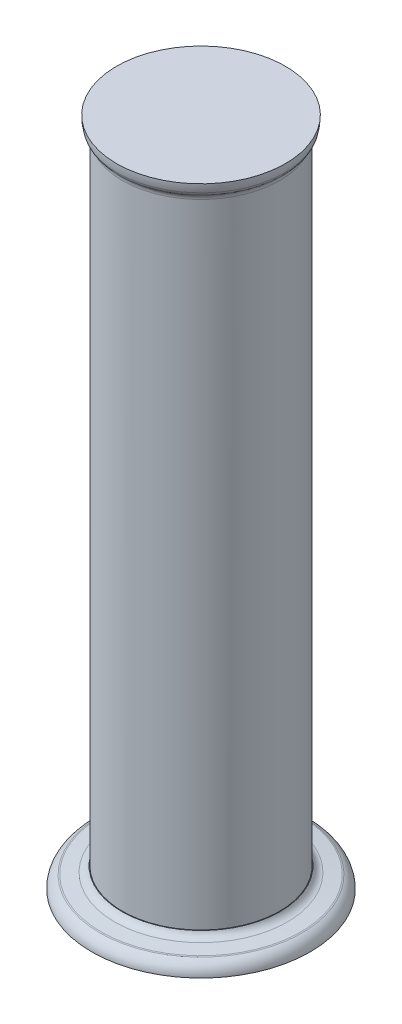
ISO-10303-21;
HEADER;
FILE_DESCRIPTION(('STEP AP214'),'2;1');
FILE_NAME('part.step','',(''),(''),'','','');
FILE_SCHEMA(('AUTOMOTIVE_DESIGN { 1 0 10303 214 1 1 1 1 }'));
ENDSEC;
DATA;
#1=APPLICATION_CONTEXT('core data for automotive mechanical design processes');
#2=APPLICATION_PROTOCOL_DEFINITION('international standard','automotive_design',2000,#1);
#3=PRODUCT_CONTEXT('',#1,'mechanical');
#4=PRODUCT('Part','Part','',(#3));
#5=PRODUCT_RELATED_PRODUCT_CATEGORY('part','',(#4));
#6=PRODUCT_DEFINITION_FORMATION('','',#4);
#7=PRODUCT_DEFINITION_CONTEXT('part definition',#1,'design');
#8=PRODUCT_DEFINITION('design','',#6,#7);
#9=PRODUCT_DEFINITION_SHAPE('','',#8);
#10=(LENGTH_UNIT() NAMED_UNIT(*) SI_UNIT(.MILLI.,.METRE.));
#11=(NAMED_UNIT(*) PLANE_ANGLE_UNIT() SI_UNIT($,.RADIAN.));
#12=(NAMED_UNIT(*) SI_UNIT($,.STERADIAN.) SOLID_ANGLE_UNIT());
#13=UNCERTAINTY_MEASURE_WITH_UNIT(LENGTH_MEASURE(1.E-05),#10,'distance_accuracy_value','');
#14=(GEOMETRIC_REPRESENTATION_CONTEXT(3) GLOBAL_UNCERTAINTY_ASSIGNED_CONTEXT((#13)) GLOBAL_UNIT_ASSIGNED_CONTEXT((#10,
#11,#12)) REPRESENTATION_CONTEXT('',''));
#15=CARTESIAN_POINT('',(0.,0.,0.));
#16=DIRECTION('',(0.,0.,1.));
#17=DIRECTION('',(1.,0.,0.));
#18=AXIS2_PLACEMENT_3D('',#15,#16,#17);
#19=CARTESIAN_POINT('',(-3.29577813896613E-12,213.800000000003,-251.000000000001));
#20=DIRECTION('',(0.,-1.,0.));
#21=DIRECTION('',(0.,0.,-1.));
#22=AXIS2_PLACEMENT_3D('',#19,#20,#21);
#23=PLANE('',#22);
#24=CARTESIAN_POINT('',(-3.29766225910432E-12,213.800000000003,-176.000000000001));
#25=DIRECTION('',(0.,1.,0.));
#26=DIRECTION('',(0.,0.,1.));
#27=AXIS2_PLACEMENT_3D('',#24,#25,#26);
#28=CIRCLE('',#27,75.);
#29=CARTESIAN_POINT('',(-3.29766225910432E-12,213.800000000003,-101.000000000001));
#30=VERTEX_POINT('',#29);
#31=EDGE_CURVE('E33',#30,#30,#28,.T.);
#32=ORIENTED_EDGE('',*,*,#31,.F.);
#33=EDGE_LOOP('',(#32));
#34=FACE_BOUND('',#33,.T.);
#35=ADVANCED_FACE('F30',(#34),#23,.T.);
#36=CARTESIAN_POINT('',(-3.29766225910432E-12,213.800000000003,-176.000000000001));
#37=DIRECTION('',(0.,1.,0.));
#38=DIRECTION('',(0.,0.,1.));
#39=AXIS2_PLACEMENT_3D('',#36,#37,#38);
#40=TOROIDAL_SURFACE('',#39,65.5989529684485,9.40104703155155);
#41=CARTESIAN_POINT('',(-3.29781962002054E-12,222.366147078511,-176.000000000001));
#42=DIRECTION('',(0.,1.,0.));
#43=DIRECTION('',(0.,0.,1.));
#44=AXIS2_PLACEMENT_3D('',#41,#42,#43);
#45=CIRCLE('',#44,69.4720408216769);
#46=CARTESIAN_POINT('',(-3.29781962002054E-12,222.366147078511,-106.527959178324));
#47=VERTEX_POINT('',#46);
#48=EDGE_CURVE('E79',#47,#47,#45,.T.);
#49=ORIENTED_EDGE('',*,*,#48,.F.);
#50=EDGE_LOOP('',(#49));
#51=FACE_BOUND('',#50,.T.);
#52=ORIENTED_EDGE('',*,*,#31,.T.);
#53=EDGE_LOOP('',(#52));
#54=FACE_BOUND('',#53,.T.);
#55=ADVANCED_FACE('F88',(#51,#54),#40,.T.);
#56=CARTESIAN_POINT('',(-3.29781962002054E-12,219.780358568721,-176.000000000001));
#57=DIRECTION('',(0.,1.,0.));
#58=DIRECTION('',(0.,0.,1.));
#59=AXIS2_PLACEMENT_3D('',#56,#57,#58);
#60=TOROIDAL_SURFACE('',#59,68.3029053893175,2.83781251610467);
#61=CARTESIAN_POINT('',(-3.30202314347965E-12,222.59701846066,-176.000000000001));
#62=DIRECTION('',(0.,-1.,0.));
#63=DIRECTION('',(0.,0.,1.));
#64=AXIS2_PLACEMENT_3D('',#61,#62,#63);
#65=CIRCLE('',#64,68.6487477373621);
#66=CARTESIAN_POINT('',(-3.30773930000587E-12,222.59701846066,-107.351252262639));
#67=VERTEX_POINT('',#66);
#68=EDGE_CURVE('E76',#67,#67,#65,.F.);
#69=ORIENTED_EDGE('',*,*,#68,.F.);
#70=EDGE_LOOP('',(#69));
#71=FACE_BOUND('',#70,.T.);
#72=ORIENTED_EDGE('',*,*,#48,.T.);
#73=EDGE_LOOP('',(#72));
#74=FACE_BOUND('',#73,.T.);
#75=ADVANCED_FACE('F84',(#71,#74),#60,.T.);
#76=CARTESIAN_POINT('',(-3.29719371126791E-12,674.400000000003,-233.999544291101));
#77=DIRECTION('',(0.,1.,0.));
#78=DIRECTION('',(0.,0.,1.));
#79=AXIS2_PLACEMENT_3D('',#76,#77,#78);
#80=PLANE('',#79);
#81=CARTESIAN_POINT('',(-3.29847169566624E-12,674.400000000003,-176.000000000001));
#82=DIRECTION('',(0.,1.,0.));
#83=DIRECTION('',(0.,0.,1.));
#84=AXIS2_PLACEMENT_3D('',#81,#82,#83);
#85=CIRCLE('',#84,57.9995442910995);
#86=CARTESIAN_POINT('',(-3.29847169566624E-12,674.400000000003,-118.000455708902));
#87=VERTEX_POINT('',#86);
#88=EDGE_CURVE('E73',#87,#87,#85,.F.);
#89=ORIENTED_EDGE('',*,*,#88,.F.);
#90=EDGE_LOOP('',(#89));
#91=FACE_BOUND('',#90,.T.);
#92=ADVANCED_FACE('F87',(#91),#80,.T.);
#93=CARTESIAN_POINT('',(-3.30202314347965E-12,222.59701846066,-176.000000000001));
#94=DIRECTION('',(0.,-1.,0.));
#95=DIRECTION('',(0.,0.,-1.));
#96=AXIS2_PLACEMENT_3D('',#93,#94,#95);
#97=CONICAL_SURFACE('',#96,68.6487477373623,1.4486232791553);
#98=ORIENTED_EDGE('',*,*,#68,.T.);
#99=EDGE_LOOP('',(#98));
#100=FACE_BOUND('',#99,.T.);
#101=CARTESIAN_POINT('',(-3.30565230980669E-12,223.748733196857,-176.000000000001));
#102=DIRECTION('',(0.,1.,0.));
#103=DIRECTION('',(0.,0.,1.));
#104=AXIS2_PLACEMENT_3D('',#101,#102,#103);
#105=CIRCLE('',#104,59.2687839395692);
#106=CARTESIAN_POINT('',(-3.30565230980669E-12,223.748733196857,-116.731216060432));
#107=VERTEX_POINT('',#106);
#108=EDGE_CURVE('E71',#107,#107,#105,.F.);
#109=ORIENTED_EDGE('',*,*,#108,.T.);
#110=EDGE_LOOP('',(#109));
#111=FACE_BOUND('',#110,.T.);
#112=ADVANCED_FACE('F104',(#100,#111),#97,.T.);
#113=CARTESIAN_POINT('',(-3.29847169566624E-12,674.548999036331,-176.000000000001));
#114=DIRECTION('',(0.,1.,0.));
#115=DIRECTION('',(0.,0.,1.));
#116=AXIS2_PLACEMENT_3D('',#113,#114,#115);
#117=TOROIDAL_SURFACE('',#116,33.642434735737,24.3575652848301);
#118=ORIENTED_EDGE('',*,*,#88,.T.);
#119=EDGE_LOOP('',(#118));
#120=FACE_BOUND('',#119,.T.);
#121=CARTESIAN_POINT('',(-3.29851886267183E-12,668.470084925447,-176.000000000001));
#122=DIRECTION('',(0.,1.,0.));
#123=DIRECTION('',(0.,0.,1.));
#124=AXIS2_PLACEMENT_3D('',#121,#122,#123);
#125=CIRCLE('',#124,57.2292486332781);
#126=CARTESIAN_POINT('',(-3.29851886267183E-12,668.470084925447,-118.770751366723));
#127=VERTEX_POINT('',#126);
#128=EDGE_CURVE('E50',#127,#127,#125,.F.);
#129=ORIENTED_EDGE('',*,*,#128,.F.);
#130=EDGE_LOOP('',(#129));
#131=FACE_BOUND('',#130,.T.);
#132=ADVANCED_FACE('F64',(#120,#131),#117,.T.);
#133=CARTESIAN_POINT('',(-3.30547800626991E-12,229.704010106705,-176.000000000001));
#134=DIRECTION('',(0.,1.,0.));
#135=DIRECTION('',(0.,0.,1.));
#136=AXIS2_PLACEMENT_3D('',#133,#134,#135);
#137=TOROIDAL_SURFACE('',#136,60.,6.00000000000001);
#138=ORIENTED_EDGE('',*,*,#108,.F.);
#139=EDGE_LOOP('',(#138));
#140=FACE_BOUND('',#139,.T.);
#141=CARTESIAN_POINT('',(-3.3055410530962E-12,227.549944183851,-176.000000000001));
#142=DIRECTION('',(0.,1.,0.));
#143=DIRECTION('',(0.,0.,1.));
#144=AXIS2_PLACEMENT_3D('',#141,#142,#143);
#145=CIRCLE('',#144,54.4);
#146=CARTESIAN_POINT('',(-3.3055410530962E-12,227.549944183851,-121.600000000001));
#147=VERTEX_POINT('',#146);
#148=EDGE_CURVE('E96',#147,#147,#145,.T.);
#149=ORIENTED_EDGE('',*,*,#148,.F.);
#150=EDGE_LOOP('',(#149));
#151=FACE_BOUND('',#150,.T.);
#152=ADVANCED_FACE('F58',(#140,#151),#137,.F.);
#153=CARTESIAN_POINT('',(-3.29851886267183E-12,669.71793421576,-176.000000000001));
#154=DIRECTION('',(0.,1.,0.));
#155=DIRECTION('',(0.,0.,1.));
#156=AXIS2_PLACEMENT_3D('',#153,#154,#155);
#157=TOROIDAL_SURFACE('',#156,52.3874646491793,5.00000000000109);
#158=ORIENTED_EDGE('',*,*,#128,.T.);
#159=EDGE_LOOP('',(#158));
#160=FACE_BOUND('',#159,.T.);
#161=CARTESIAN_POINT('',(-3.30328899422403E-12,666.220594287331,-176.000000000001));
#162=DIRECTION('',(0.,1.,0.));
#163=DIRECTION('',(-1.,0.,0.));
#164=AXIS2_PLACEMENT_3D('',#161,#162,#163);
#165=CIRCLE('',#164,55.9607843137254);
#166=CARTESIAN_POINT('',(-55.9607843137287,666.220594287331,-176.000000000001));
#167=VERTEX_POINT('',#166);
#168=EDGE_CURVE('E42',#167,#167,#165,.T.);
#169=ORIENTED_EDGE('',*,*,#168,.T.);
#170=EDGE_LOOP('',(#169));
#171=FACE_BOUND('',#170,.T.);
#172=ADVANCED_FACE('F53',(#160,#171),#157,.T.);
#173=CARTESIAN_POINT('',(-3.29749343353917E-12,227.549944183851,-230.400000000001));
#174=DIRECTION('',(0.,1.,0.));
#175=DIRECTION('',(0.,0.,1.));
#176=AXIS2_PLACEMENT_3D('',#173,#174,#175);
#177=PLANE('',#176);
#178=CARTESIAN_POINT('',(-3.30202314347965E-12,227.549944183851,-176.000000000001));
#179=DIRECTION('',(0.,-1.,0.));
#180=DIRECTION('',(0.,0.,-1.));
#181=AXIS2_PLACEMENT_3D('',#178,#179,#180);
#182=CIRCLE('',#181,54.);
#183=CARTESIAN_POINT('',(-3.30202314347965E-12,227.549944183851,-230.000000000001));
#184=VERTEX_POINT('',#183);
#185=EDGE_CURVE('E37',#184,#184,#182,.F.);
#186=ORIENTED_EDGE('',*,*,#185,.F.);
#187=EDGE_LOOP('',(#186));
#188=FACE_BOUND('',#187,.T.);
#189=ORIENTED_EDGE('',*,*,#148,.T.);
#190=EDGE_LOOP('',(#189));
#191=FACE_BOUND('',#190,.T.);
#192=ADVANCED_FACE('F57',(#188,#191),#177,.T.);
#193=CARTESIAN_POINT('',(-3.30532968983734E-12,662.25030865374,-176.000000000001));
#194=DIRECTION('',(0.,1.,0.));
#195=DIRECTION('',(-1.,0.,0.));
#196=AXIS2_PLACEMENT_3D('',#193,#194,#195);
#197=TOROIDAL_SURFACE('',#196,59.0000000000003,5.00000000000024);
#198=CARTESIAN_POINT('',(-3.30202314347965E-12,662.25030865374,-176.000000000001));
#199=DIRECTION('',(0.,-1.,0.));
#200=DIRECTION('',(0.,0.,-1.));
#201=AXIS2_PLACEMENT_3D('',#198,#199,#200);
#202=CIRCLE('',#201,54.);
#203=CARTESIAN_POINT('',(-3.30202314347965E-12,662.25030865374,-230.000000000001));
#204=VERTEX_POINT('',#203);
#205=EDGE_CURVE('E10',#204,#204,#202,.T.);
#206=ORIENTED_EDGE('',*,*,#205,.F.);
#207=EDGE_LOOP('',(#206));
#208=FACE_BOUND('',#207,.T.);
#209=ORIENTED_EDGE('',*,*,#168,.F.);
#210=EDGE_LOOP('',(#209));
#211=FACE_BOUND('',#210,.T.);
#212=ADVANCED_FACE('F111',(#208,#211),#197,.F.);
#213=CARTESIAN_POINT('',(-3.30202314347965E-12,213.800000000003,-176.000000000001));
#214=DIRECTION('',(0.,-1.,0.));
#215=DIRECTION('',(0.,0.,-1.));
#216=AXIS2_PLACEMENT_3D('',#213,#214,#215);
#217=CYLINDRICAL_SURFACE('',#216,54.);
#218=ORIENTED_EDGE('',*,*,#185,.T.);
#219=EDGE_LOOP('',(#218));
#220=FACE_BOUND('',#219,.T.);
#221=ORIENTED_EDGE('',*,*,#205,.T.);
#222=EDGE_LOOP('',(#221));
#223=FACE_BOUND('',#222,.T.);
#224=ADVANCED_FACE('F109',(#220,#223),#217,.T.);
#225=CLOSED_SHELL('',(#35,#55,#75,#92,#112,#132,#152,#172,#192,#212,#224));
#226=MANIFOLD_SOLID_BREP('B2',#225);
#227=ADVANCED_BREP_SHAPE_REPRESENTATION('',(#18,#226),#14);
#228=SHAPE_DEFINITION_REPRESENTATION(#9,#227);
ENDSEC;
END-ISO-10303-21;
